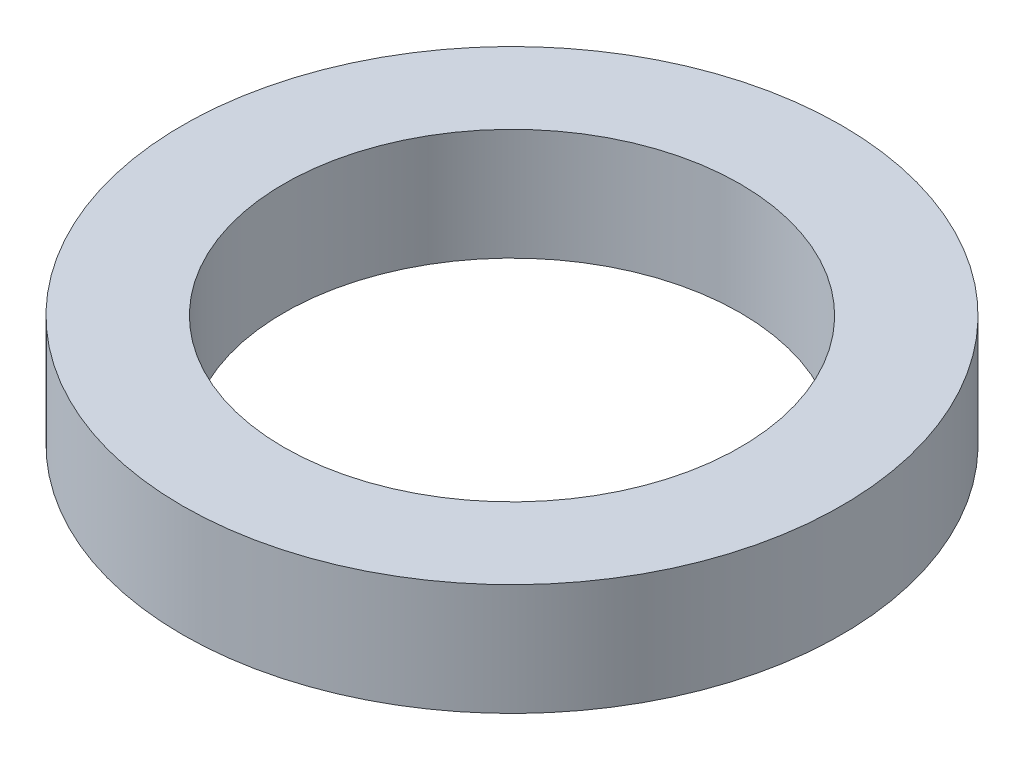
ISO-10303-21;
HEADER;
FILE_DESCRIPTION(('STEP AP214'),'2;1');
FILE_NAME('part.step','',(''),(''),'','','');
FILE_SCHEMA(('AUTOMOTIVE_DESIGN { 1 0 10303 214 1 1 1 1 }'));
ENDSEC;
DATA;
#1=APPLICATION_CONTEXT('core data for automotive mechanical design processes');
#2=APPLICATION_PROTOCOL_DEFINITION('international standard','automotive_design',2000,#1);
#3=PRODUCT_CONTEXT('',#1,'mechanical');
#4=PRODUCT('Part','Part','',(#3));
#5=PRODUCT_RELATED_PRODUCT_CATEGORY('part','',(#4));
#6=PRODUCT_DEFINITION_FORMATION('','',#4);
#7=PRODUCT_DEFINITION_CONTEXT('part definition',#1,'design');
#8=PRODUCT_DEFINITION('design','',#6,#7);
#9=PRODUCT_DEFINITION_SHAPE('','',#8);
#10=(LENGTH_UNIT() NAMED_UNIT(*) SI_UNIT(.MILLI.,.METRE.));
#11=(NAMED_UNIT(*) PLANE_ANGLE_UNIT() SI_UNIT($,.RADIAN.));
#12=(NAMED_UNIT(*) SI_UNIT($,.STERADIAN.) SOLID_ANGLE_UNIT());
#13=UNCERTAINTY_MEASURE_WITH_UNIT(LENGTH_MEASURE(1.E-05),#10,'distance_accuracy_value','');
#14=(GEOMETRIC_REPRESENTATION_CONTEXT(3) GLOBAL_UNCERTAINTY_ASSIGNED_CONTEXT((#13)) GLOBAL_UNIT_ASSIGNED_CONTEXT((#10,
#11,#12)) REPRESENTATION_CONTEXT('',''));
#15=CARTESIAN_POINT('',(0.,0.,0.));
#16=DIRECTION('',(0.,0.,1.));
#17=DIRECTION('',(1.,0.,0.));
#18=AXIS2_PLACEMENT_3D('',#15,#16,#17);
#19=CARTESIAN_POINT('',(0.,11.,0.));
#20=DIRECTION('',(0.,-1.,0.));
#21=DIRECTION('',(0.,0.,-1.));
#22=AXIS2_PLACEMENT_3D('',#19,#20,#21);
#23=CYLINDRICAL_SURFACE('',#22,32.5);
#24=CARTESIAN_POINT('',(0.,11.,0.));
#25=DIRECTION('',(0.,1.,0.));
#26=DIRECTION('',(0.,0.,1.));
#27=AXIS2_PLACEMENT_3D('',#24,#25,#26);
#28=CIRCLE('',#27,32.5);
#29=CARTESIAN_POINT('',(0.,11.,32.5));
#30=VERTEX_POINT('',#29);
#31=EDGE_CURVE('E10',#30,#30,#28,.T.);
#32=ORIENTED_EDGE('',*,*,#31,.F.);
#33=EDGE_LOOP('',(#32));
#34=FACE_BOUND('',#33,.T.);
#35=CARTESIAN_POINT('',(0.,0.,0.));
#36=DIRECTION('',(0.,1.,0.));
#37=DIRECTION('',(0.,0.,1.));
#38=AXIS2_PLACEMENT_3D('',#35,#36,#37);
#39=CIRCLE('',#38,32.5);
#40=CARTESIAN_POINT('',(0.,0.,32.5));
#41=VERTEX_POINT('',#40);
#42=EDGE_CURVE('E37',#41,#41,#39,.T.);
#43=ORIENTED_EDGE('',*,*,#42,.T.);
#44=EDGE_LOOP('',(#43));
#45=FACE_BOUND('',#44,.T.);
#46=ADVANCED_FACE('F40',(#34,#45),#23,.T.);
#47=CARTESIAN_POINT('',(0.,11.,0.));
#48=DIRECTION('',(0.,1.,0.));
#49=DIRECTION('',(0.,0.,1.));
#50=AXIS2_PLACEMENT_3D('',#47,#48,#49);
#51=PLANE('',#50);
#52=CARTESIAN_POINT('',(0.,11.,0.));
#53=DIRECTION('',(0.,1.,0.));
#54=DIRECTION('',(0.,0.,1.));
#55=AXIS2_PLACEMENT_3D('',#52,#53,#54);
#56=CIRCLE('',#55,22.5);
#57=CARTESIAN_POINT('',(0.,11.,22.5));
#58=VERTEX_POINT('',#57);
#59=EDGE_CURVE('E50',#58,#58,#56,.T.);
#60=ORIENTED_EDGE('',*,*,#59,.F.);
#61=EDGE_LOOP('',(#60));
#62=FACE_BOUND('',#61,.T.);
#63=ORIENTED_EDGE('',*,*,#31,.T.);
#64=EDGE_LOOP('',(#63));
#65=FACE_BOUND('',#64,.T.);
#66=ADVANCED_FACE('F59',(#62,#65),#51,.T.);
#67=CARTESIAN_POINT('',(0.,0.,0.));
#68=DIRECTION('',(0.,1.,0.));
#69=DIRECTION('',(0.,0.,1.));
#70=AXIS2_PLACEMENT_3D('',#67,#68,#69);
#71=PLANE('',#70);
#72=CARTESIAN_POINT('',(0.,0.,0.));
#73=DIRECTION('',(0.,1.,0.));
#74=DIRECTION('',(0.,0.,1.));
#75=AXIS2_PLACEMENT_3D('',#72,#73,#74);
#76=CIRCLE('',#75,22.5);
#77=CARTESIAN_POINT('',(0.,0.,22.5));
#78=VERTEX_POINT('',#77);
#79=EDGE_CURVE('E47',#78,#78,#76,.T.);
#80=ORIENTED_EDGE('',*,*,#79,.T.);
#81=EDGE_LOOP('',(#80));
#82=FACE_BOUND('',#81,.T.);
#83=ORIENTED_EDGE('',*,*,#42,.F.);
#84=EDGE_LOOP('',(#83));
#85=FACE_BOUND('',#84,.T.);
#86=ADVANCED_FACE('F58',(#82,#85),#71,.F.);
#87=CARTESIAN_POINT('',(0.,11.,0.));
#88=DIRECTION('',(0.,-1.,0.));
#89=DIRECTION('',(0.,0.,-1.));
#90=AXIS2_PLACEMENT_3D('',#87,#88,#89);
#91=CYLINDRICAL_SURFACE('',#90,22.5);
#92=ORIENTED_EDGE('',*,*,#59,.T.);
#93=EDGE_LOOP('',(#92));
#94=FACE_BOUND('',#93,.T.);
#95=ORIENTED_EDGE('',*,*,#79,.F.);
#96=EDGE_LOOP('',(#95));
#97=FACE_BOUND('',#96,.T.);
#98=ADVANCED_FACE('F54',(#94,#97),#91,.F.);
#99=CLOSED_SHELL('',(#46,#66,#86,#98));
#100=MANIFOLD_SOLID_BREP('B2',#99);
#101=ADVANCED_BREP_SHAPE_REPRESENTATION('',(#18,#100),#14);
#102=SHAPE_DEFINITION_REPRESENTATION(#9,#101);
ENDSEC;
END-ISO-10303-21;
